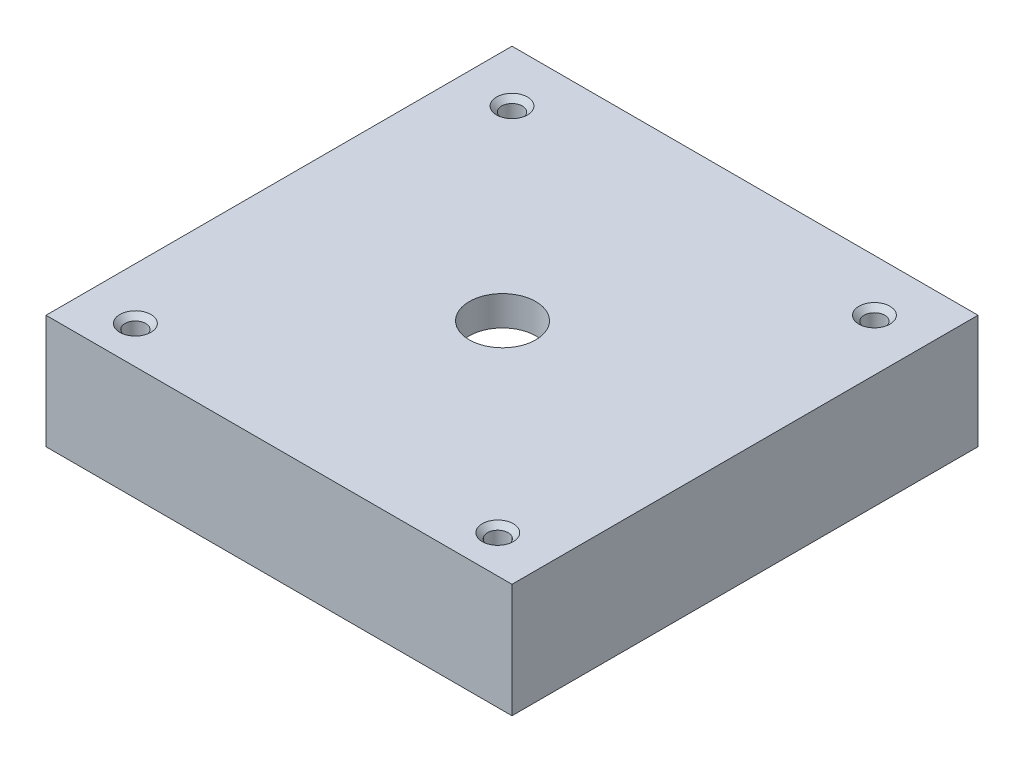
ISO-10303-21;
HEADER;
FILE_DESCRIPTION(('STEP AP214'),'2;1');
FILE_NAME('part.step','',(''),(''),'','','');
FILE_SCHEMA(('AUTOMOTIVE_DESIGN { 1 0 10303 214 1 1 1 1 }'));
ENDSEC;
DATA;
#1=APPLICATION_CONTEXT('core data for automotive mechanical design processes');
#2=APPLICATION_PROTOCOL_DEFINITION('international standard','automotive_design',2000,#1);
#3=PRODUCT_CONTEXT('',#1,'mechanical');
#4=PRODUCT('Part','Part','',(#3));
#5=PRODUCT_RELATED_PRODUCT_CATEGORY('part','',(#4));
#6=PRODUCT_DEFINITION_FORMATION('','',#4);
#7=PRODUCT_DEFINITION_CONTEXT('part definition',#1,'design');
#8=PRODUCT_DEFINITION('design','',#6,#7);
#9=PRODUCT_DEFINITION_SHAPE('','',#8);
#10=(LENGTH_UNIT() NAMED_UNIT(*) SI_UNIT(.MILLI.,.METRE.));
#11=(NAMED_UNIT(*) PLANE_ANGLE_UNIT() SI_UNIT($,.RADIAN.));
#12=(NAMED_UNIT(*) SI_UNIT($,.STERADIAN.) SOLID_ANGLE_UNIT());
#13=UNCERTAINTY_MEASURE_WITH_UNIT(LENGTH_MEASURE(1.E-05),#10,'distance_accuracy_value','');
#14=(GEOMETRIC_REPRESENTATION_CONTEXT(3) GLOBAL_UNCERTAINTY_ASSIGNED_CONTEXT((#13)) GLOBAL_UNIT_ASSIGNED_CONTEXT((#10,
#11,#12)) REPRESENTATION_CONTEXT('',''));
#15=CARTESIAN_POINT('',(0.,0.,0.));
#16=DIRECTION('',(0.,0.,1.));
#17=DIRECTION('',(1.,0.,0.));
#18=AXIS2_PLACEMENT_3D('',#15,#16,#17);
#19=CARTESIAN_POINT('',(0.,22.,0.));
#20=DIRECTION('',(1.,0.,0.));
#21=DIRECTION('',(0.,0.,-1.));
#22=AXIS2_PLACEMENT_3D('',#19,#20,#21);
#23=PLANE('',#22);
#24=DIRECTION('',(0.,0.,1.));
#25=VECTOR('',#24,1.);
#26=CARTESIAN_POINT('',(0.,0.,0.));
#27=LINE('',#26,#25);
#28=CARTESIAN_POINT('',(0.,0.,-90.01));
#29=VERTEX_POINT('',#28);
#30=CARTESIAN_POINT('',(0.,0.,0.));
#31=VERTEX_POINT('',#30);
#32=EDGE_CURVE('E197',#29,#31,#27,.T.);
#33=ORIENTED_EDGE('',*,*,#32,.T.);
#34=DIRECTION('',(0.,-1.,0.));
#35=VECTOR('',#34,1.);
#36=CARTESIAN_POINT('',(0.,22.,0.));
#37=LINE('',#36,#35);
#38=CARTESIAN_POINT('',(0.,22.,0.));
#39=VERTEX_POINT('',#38);
#40=EDGE_CURVE('E212',#39,#31,#37,.T.);
#41=ORIENTED_EDGE('',*,*,#40,.F.);
#42=DIRECTION('',(0.,0.,1.));
#43=VECTOR('',#42,1.);
#44=CARTESIAN_POINT('',(0.,22.,0.));
#45=LINE('',#44,#43);
#46=CARTESIAN_POINT('',(0.,22.,-90.01));
#47=VERTEX_POINT('',#46);
#48=EDGE_CURVE('E190',#47,#39,#45,.T.);
#49=ORIENTED_EDGE('',*,*,#48,.F.);
#50=DIRECTION('',(0.,-1.,0.));
#51=VECTOR('',#50,1.);
#52=CARTESIAN_POINT('',(0.,22.,-90.01));
#53=LINE('',#52,#51);
#54=EDGE_CURVE('E196',#47,#29,#53,.T.);
#55=ORIENTED_EDGE('',*,*,#54,.T.);
#56=EDGE_LOOP('',(#33,#41,#49,#55));
#57=FACE_BOUND('',#56,.T.);
#58=ADVANCED_FACE('F44',(#57),#23,.F.);
#59=CARTESIAN_POINT('',(0.,22.,0.));
#60=DIRECTION('',(0.,0.,-1.));
#61=DIRECTION('',(-1.,0.,0.));
#62=AXIS2_PLACEMENT_3D('',#59,#60,#61);
#63=PLANE('',#62);
#64=DIRECTION('',(1.,0.,0.));
#65=VECTOR('',#64,1.);
#66=CARTESIAN_POINT('',(0.,0.,0.));
#67=LINE('',#66,#65);
#68=CARTESIAN_POINT('',(90.,0.,0.));
#69=VERTEX_POINT('',#68);
#70=EDGE_CURVE('E200',#31,#69,#67,.T.);
#71=ORIENTED_EDGE('',*,*,#70,.T.);
#72=DIRECTION('',(0.,-1.,0.));
#73=VECTOR('',#72,1.);
#74=CARTESIAN_POINT('',(90.,22.,0.));
#75=LINE('',#74,#73);
#76=CARTESIAN_POINT('',(90.,22.,0.));
#77=VERTEX_POINT('',#76);
#78=EDGE_CURVE('E209',#77,#69,#75,.T.);
#79=ORIENTED_EDGE('',*,*,#78,.F.);
#80=DIRECTION('',(1.,0.,0.));
#81=VECTOR('',#80,1.);
#82=CARTESIAN_POINT('',(0.,22.,0.));
#83=LINE('',#82,#81);
#84=EDGE_CURVE('E97',#39,#77,#83,.T.);
#85=ORIENTED_EDGE('',*,*,#84,.F.);
#86=ORIENTED_EDGE('',*,*,#40,.T.);
#87=EDGE_LOOP('',(#71,#79,#85,#86));
#88=FACE_BOUND('',#87,.T.);
#89=ADVANCED_FACE('F268',(#88),#63,.F.);
#90=CARTESIAN_POINT('',(90.,22.,0.));
#91=DIRECTION('',(-1.,0.,0.));
#92=DIRECTION('',(0.,0.,1.));
#93=AXIS2_PLACEMENT_3D('',#90,#91,#92);
#94=PLANE('',#93);
#95=DIRECTION('',(0.,0.,-1.));
#96=VECTOR('',#95,1.);
#97=CARTESIAN_POINT('',(90.,0.,0.));
#98=LINE('',#97,#96);
#99=CARTESIAN_POINT('',(90.,0.,-90.01));
#100=VERTEX_POINT('',#99);
#101=EDGE_CURVE('E203',#69,#100,#98,.T.);
#102=ORIENTED_EDGE('',*,*,#101,.T.);
#103=DIRECTION('',(0.,-1.,0.));
#104=VECTOR('',#103,1.);
#105=CARTESIAN_POINT('',(90.,22.,-90.01));
#106=LINE('',#105,#104);
#107=CARTESIAN_POINT('',(90.,22.,-90.01));
#108=VERTEX_POINT('',#107);
#109=EDGE_CURVE('E207',#108,#100,#106,.T.);
#110=ORIENTED_EDGE('',*,*,#109,.F.);
#111=DIRECTION('',(0.,0.,-1.));
#112=VECTOR('',#111,1.);
#113=CARTESIAN_POINT('',(90.,22.,0.));
#114=LINE('',#113,#112);
#115=EDGE_CURVE('E193',#77,#108,#114,.T.);
#116=ORIENTED_EDGE('',*,*,#115,.F.);
#117=ORIENTED_EDGE('',*,*,#78,.T.);
#118=EDGE_LOOP('',(#102,#110,#116,#117));
#119=FACE_BOUND('',#118,.T.);
#120=ADVANCED_FACE('F273',(#119),#94,.F.);
#121=CARTESIAN_POINT('',(0.,22.,-90.01));
#122=DIRECTION('',(0.,0.,1.));
#123=DIRECTION('',(1.,0.,0.));
#124=AXIS2_PLACEMENT_3D('',#121,#122,#123);
#125=PLANE('',#124);
#126=DIRECTION('',(-1.,0.,0.));
#127=VECTOR('',#126,1.);
#128=CARTESIAN_POINT('',(0.,0.,-90.01));
#129=LINE('',#128,#127);
#130=EDGE_CURVE('E89',#100,#29,#129,.T.);
#131=ORIENTED_EDGE('',*,*,#130,.T.);
#132=ORIENTED_EDGE('',*,*,#54,.F.);
#133=DIRECTION('',(-1.,0.,0.));
#134=VECTOR('',#133,1.);
#135=CARTESIAN_POINT('',(0.,22.,-90.01));
#136=LINE('',#135,#134);
#137=EDGE_CURVE('E68',#108,#47,#136,.T.);
#138=ORIENTED_EDGE('',*,*,#137,.F.);
#139=ORIENTED_EDGE('',*,*,#109,.T.);
#140=EDGE_LOOP('',(#131,#132,#138,#139));
#141=FACE_BOUND('',#140,.T.);
#142=ADVANCED_FACE('F257',(#141),#125,.F.);
#143=CARTESIAN_POINT('',(0.,22.,0.));
#144=DIRECTION('',(0.,-1.,0.));
#145=DIRECTION('',(0.,0.,-1.));
#146=AXIS2_PLACEMENT_3D('',#143,#144,#145);
#147=PLANE('',#146);
#148=CARTESIAN_POINT('',(9.99700000000003,22.,-80.01));
#149=DIRECTION('',(0.,-1.,0.));
#150=DIRECTION('',(0.,0.,-1.));
#151=AXIS2_PLACEMENT_3D('',#148,#149,#150);
#152=CIRCLE('',#151,2.99999999999998);
#153=CARTESIAN_POINT('',(9.99700000000003,22.,-83.01));
#154=VERTEX_POINT('',#153);
#155=EDGE_CURVE('E233',#154,#154,#152,.T.);
#156=ORIENTED_EDGE('',*,*,#155,.T.);
#157=EDGE_LOOP('',(#156));
#158=FACE_BOUND('',#157,.T.);
#159=CARTESIAN_POINT('',(9.99700000000003,22.,-7.26557948291047));
#160=DIRECTION('',(0.,-1.,0.));
#161=DIRECTION('',(0.,0.,-1.));
#162=AXIS2_PLACEMENT_3D('',#159,#160,#161);
#163=CIRCLE('',#162,2.99999999999999);
#164=CARTESIAN_POINT('',(9.99700000000003,22.,-10.2655794829105));
#165=VERTEX_POINT('',#164);
#166=EDGE_CURVE('E230',#165,#165,#163,.T.);
#167=ORIENTED_EDGE('',*,*,#166,.T.);
#168=EDGE_LOOP('',(#167));
#169=FACE_BOUND('',#168,.T.);
#170=CARTESIAN_POINT('',(79.997,22.,-80.01));
#171=DIRECTION('',(0.,-1.,0.));
#172=DIRECTION('',(0.,0.,-1.));
#173=AXIS2_PLACEMENT_3D('',#170,#171,#172);
#174=CIRCLE('',#173,2.99999999999998);
#175=CARTESIAN_POINT('',(79.997,22.,-83.01));
#176=VERTEX_POINT('',#175);
#177=EDGE_CURVE('E227',#176,#176,#174,.T.);
#178=ORIENTED_EDGE('',*,*,#177,.T.);
#179=EDGE_LOOP('',(#178));
#180=FACE_BOUND('',#179,.T.);
#181=CARTESIAN_POINT('',(79.997,22.,-7.26557948291046));
#182=DIRECTION('',(0.,-1.,0.));
#183=DIRECTION('',(0.,0.,-1.));
#184=AXIS2_PLACEMENT_3D('',#181,#182,#183);
#185=CIRCLE('',#184,2.99999999999999);
#186=CARTESIAN_POINT('',(79.997,22.,-10.2655794829105));
#187=VERTEX_POINT('',#186);
#188=EDGE_CURVE('E214',#187,#187,#185,.T.);
#189=ORIENTED_EDGE('',*,*,#188,.T.);
#190=EDGE_LOOP('',(#189));
#191=FACE_BOUND('',#190,.T.);
#192=CARTESIAN_POINT('',(44.9963085252732,22.,-43.1781197698745));
#193=DIRECTION('',(0.,-1.,0.));
#194=DIRECTION('',(0.,0.,-1.));
#195=AXIS2_PLACEMENT_3D('',#192,#193,#194);
#196=CIRCLE('',#195,6.4168545848649);
#197=CARTESIAN_POINT('',(44.9963085252732,22.,-49.5949743547394));
#198=VERTEX_POINT('',#197);
#199=EDGE_CURVE('E170',#198,#198,#196,.T.);
#200=ORIENTED_EDGE('',*,*,#199,.T.);
#201=EDGE_LOOP('',(#200));
#202=FACE_BOUND('',#201,.T.);
#203=ORIENTED_EDGE('',*,*,#48,.T.);
#204=ORIENTED_EDGE('',*,*,#84,.T.);
#205=ORIENTED_EDGE('',*,*,#115,.T.);
#206=ORIENTED_EDGE('',*,*,#137,.T.);
#207=EDGE_LOOP('',(#203,#204,#205,#206));
#208=FACE_BOUND('',#207,.T.);
#209=ADVANCED_FACE('F253',(#158,#169,#180,#191,#202,#208),#147,.F.);
#210=CARTESIAN_POINT('',(0.,0.,0.));
#211=DIRECTION('',(0.,-1.,0.));
#212=DIRECTION('',(0.,0.,-1.));
#213=AXIS2_PLACEMENT_3D('',#210,#211,#212);
#214=PLANE('',#213);
#215=CARTESIAN_POINT('',(63.8998085252733,0.,-32.2641789562485));
#216=DIRECTION('',(0.,-1.,0.));
#217=DIRECTION('',(0.,0.,-1.));
#218=AXIS2_PLACEMENT_3D('',#215,#216,#217);
#219=CIRCLE('',#218,20.5);
#220=CARTESIAN_POINT('',(80.8420507654955,0.,-43.8058611505229));
#221=VERTEX_POINT('',#220);
#222=CARTESIAN_POINT('',(63.8998085252733,0.,-11.7641789562485));
#223=VERTEX_POINT('',#222);
#224=EDGE_CURVE('E59',#221,#223,#219,.T.);
#225=ORIENTED_EDGE('',*,*,#224,.F.);
#226=DIRECTION('',(0.498644314109177,0.,0.866806695870878));
#227=VECTOR('',#226,1.);
#228=CARTESIAN_POINT('',(80.8420507654955,0.,-43.8058611505229));
#229=LINE('',#228,#227);
#230=CARTESIAN_POINT('',(62.7658457906263,0.,-75.2282098363649));
#231=VERTEX_POINT('',#230);
#232=EDGE_CURVE('E152',#231,#221,#229,.T.);
#233=ORIENTED_EDGE('',*,*,#232,.F.);
#234=CARTESIAN_POINT('',(44.9963085252733,0.,-65.0060013971268));
#235=DIRECTION('',(0.,-1.,0.));
#236=DIRECTION('',(0.,0.,-1.));
#237=AXIS2_PLACEMENT_3D('',#234,#235,#236);
#238=CIRCLE('',#237,20.5);
#239=CARTESIAN_POINT('',(27.2427877476923,0.,-75.2560013971268));
#240=VERTEX_POINT('',#239);
#241=EDGE_CURVE('E155',#240,#231,#238,.T.);
#242=ORIENTED_EDGE('',*,*,#241,.F.);
#243=DIRECTION('',(0.5,0.,-0.866025403784438));
#244=VECTOR('',#243,1.);
#245=CARTESIAN_POINT('',(8.33928774769229,0.,-42.5141789562485));
#246=LINE('',#245,#244);
#247=CARTESIAN_POINT('',(8.33928774769229,0.,-42.5141789562485));
#248=VERTEX_POINT('',#247);
#249=EDGE_CURVE('E175',#248,#240,#246,.T.);
#250=ORIENTED_EDGE('',*,*,#249,.F.);
#251=CARTESIAN_POINT('',(26.0928085252733,0.,-32.2641789562485));
#252=DIRECTION('',(0.,-1.,0.));
#253=DIRECTION('',(0.,0.,-1.));
#254=AXIS2_PLACEMENT_3D('',#251,#252,#253);
#255=CIRCLE('',#254,20.5);
#256=CARTESIAN_POINT('',(26.0928085252733,0.,-11.7641789562485));
#257=VERTEX_POINT('',#256);
#258=EDGE_CURVE('E172',#257,#248,#255,.T.);
#259=ORIENTED_EDGE('',*,*,#258,.F.);
#260=DIRECTION('',(-1.,0.,0.));
#261=VECTOR('',#260,1.);
#262=CARTESIAN_POINT('',(26.0928085252733,0.,-11.7641789562485));
#263=LINE('',#262,#261);
#264=EDGE_CURVE('E169',#223,#257,#263,.T.);
#265=ORIENTED_EDGE('',*,*,#264,.F.);
#266=EDGE_LOOP('',(#225,#233,#242,#250,#259,#265));
#267=FACE_BOUND('',#266,.T.);
#268=CARTESIAN_POINT('',(9.99700000000003,0.,-80.01));
#269=DIRECTION('',(0.,-1.,0.));
#270=DIRECTION('',(0.,0.,-1.));
#271=AXIS2_PLACEMENT_3D('',#268,#269,#270);
#272=CIRCLE('',#271,2.);
#273=CARTESIAN_POINT('',(9.99700000000003,0.,-82.01));
#274=VERTEX_POINT('',#273);
#275=EDGE_CURVE('E217',#274,#274,#272,.T.);
#276=ORIENTED_EDGE('',*,*,#275,.F.);
#277=EDGE_LOOP('',(#276));
#278=FACE_BOUND('',#277,.T.);
#279=CARTESIAN_POINT('',(79.997,0.,-7.26557948291046));
#280=DIRECTION('',(0.,-1.,0.));
#281=DIRECTION('',(0.,0.,-1.));
#282=AXIS2_PLACEMENT_3D('',#279,#280,#281);
#283=CIRCLE('',#282,2.);
#284=CARTESIAN_POINT('',(79.997,0.,-9.26557948291046));
#285=VERTEX_POINT('',#284);
#286=EDGE_CURVE('E220',#285,#285,#283,.T.);
#287=ORIENTED_EDGE('',*,*,#286,.F.);
#288=EDGE_LOOP('',(#287));
#289=FACE_BOUND('',#288,.T.);
#290=CARTESIAN_POINT('',(79.997,0.,-80.01));
#291=DIRECTION('',(0.,-1.,0.));
#292=DIRECTION('',(0.,0.,-1.));
#293=AXIS2_PLACEMENT_3D('',#290,#291,#292);
#294=CIRCLE('',#293,2.);
#295=CARTESIAN_POINT('',(79.997,0.,-82.01));
#296=VERTEX_POINT('',#295);
#297=EDGE_CURVE('E182',#296,#296,#294,.T.);
#298=ORIENTED_EDGE('',*,*,#297,.F.);
#299=EDGE_LOOP('',(#298));
#300=FACE_BOUND('',#299,.T.);
#301=CARTESIAN_POINT('',(9.99700000000003,0.,-7.26557948291047));
#302=DIRECTION('',(0.,-1.,0.));
#303=DIRECTION('',(0.,0.,-1.));
#304=AXIS2_PLACEMENT_3D('',#301,#302,#303);
#305=CIRCLE('',#304,2.);
#306=CARTESIAN_POINT('',(9.99700000000003,0.,-9.26557948291047));
#307=VERTEX_POINT('',#306);
#308=EDGE_CURVE('E201',#307,#307,#305,.T.);
#309=ORIENTED_EDGE('',*,*,#308,.F.);
#310=EDGE_LOOP('',(#309));
#311=FACE_BOUND('',#310,.T.);
#312=ORIENTED_EDGE('',*,*,#32,.F.);
#313=ORIENTED_EDGE('',*,*,#130,.F.);
#314=ORIENTED_EDGE('',*,*,#101,.F.);
#315=ORIENTED_EDGE('',*,*,#70,.F.);
#316=EDGE_LOOP('',(#312,#313,#314,#315));
#317=FACE_BOUND('',#316,.T.);
#318=ADVANCED_FACE('F256',(#267,#278,#289,#300,#311,#317),#214,.T.);
#319=CARTESIAN_POINT('',(9.99700000000003,22.,-7.26557948291047));
#320=DIRECTION('',(0.,-1.,0.));
#321=DIRECTION('',(0.,0.,-1.));
#322=AXIS2_PLACEMENT_3D('',#319,#320,#321);
#323=CYLINDRICAL_SURFACE('',#322,2.);
#324=CARTESIAN_POINT('',(9.99700000000003,21.,-7.26557948291047));
#325=DIRECTION('',(0.,-1.,0.));
#326=DIRECTION('',(0.,0.,-1.));
#327=AXIS2_PLACEMENT_3D('',#324,#325,#326);
#328=CIRCLE('',#327,2.);
#329=CARTESIAN_POINT('',(9.99700000000003,21.,-9.26557948291047));
#330=VERTEX_POINT('',#329);
#331=EDGE_CURVE('E239',#330,#330,#328,.F.);
#332=ORIENTED_EDGE('',*,*,#331,.T.);
#333=EDGE_LOOP('',(#332));
#334=FACE_BOUND('',#333,.T.);
#335=ORIENTED_EDGE('',*,*,#308,.T.);
#336=EDGE_LOOP('',(#335));
#337=FACE_BOUND('',#336,.T.);
#338=ADVANCED_FACE('F276',(#334,#337),#323,.F.);
#339=CARTESIAN_POINT('',(79.997,22.,-80.01));
#340=DIRECTION('',(0.,-1.,0.));
#341=DIRECTION('',(0.,0.,-1.));
#342=AXIS2_PLACEMENT_3D('',#339,#340,#341);
#343=CYLINDRICAL_SURFACE('',#342,2.);
#344=CARTESIAN_POINT('',(79.997,21.,-80.01));
#345=DIRECTION('',(0.,-1.,0.));
#346=DIRECTION('',(0.,0.,-1.));
#347=AXIS2_PLACEMENT_3D('',#344,#345,#346);
#348=CIRCLE('',#347,2.);
#349=CARTESIAN_POINT('',(79.997,21.,-82.01));
#350=VERTEX_POINT('',#349);
#351=EDGE_CURVE('E52',#350,#350,#348,.F.);
#352=ORIENTED_EDGE('',*,*,#351,.T.);
#353=EDGE_LOOP('',(#352));
#354=FACE_BOUND('',#353,.T.);
#355=ORIENTED_EDGE('',*,*,#297,.T.);
#356=EDGE_LOOP('',(#355));
#357=FACE_BOUND('',#356,.T.);
#358=ADVANCED_FACE('F244',(#354,#357),#343,.F.);
#359=CARTESIAN_POINT('',(79.997,22.,-7.26557948291046));
#360=DIRECTION('',(0.,-1.,0.));
#361=DIRECTION('',(0.,0.,-1.));
#362=AXIS2_PLACEMENT_3D('',#359,#360,#361);
#363=CYLINDRICAL_SURFACE('',#362,2.);
#364=CARTESIAN_POINT('',(79.997,21.,-7.26557948291046));
#365=DIRECTION('',(0.,-1.,0.));
#366=DIRECTION('',(0.,0.,-1.));
#367=AXIS2_PLACEMENT_3D('',#364,#365,#366);
#368=CIRCLE('',#367,2.);
#369=CARTESIAN_POINT('',(79.997,21.,-9.26557948291046));
#370=VERTEX_POINT('',#369);
#371=EDGE_CURVE('E13',#370,#370,#368,.F.);
#372=ORIENTED_EDGE('',*,*,#371,.T.);
#373=EDGE_LOOP('',(#372));
#374=FACE_BOUND('',#373,.T.);
#375=ORIENTED_EDGE('',*,*,#286,.T.);
#376=EDGE_LOOP('',(#375));
#377=FACE_BOUND('',#376,.T.);
#378=ADVANCED_FACE('F408',(#374,#377),#363,.F.);
#379=CARTESIAN_POINT('',(9.99700000000003,22.,-80.01));
#380=DIRECTION('',(0.,-1.,0.));
#381=DIRECTION('',(0.,0.,-1.));
#382=AXIS2_PLACEMENT_3D('',#379,#380,#381);
#383=CYLINDRICAL_SURFACE('',#382,2.);
#384=CARTESIAN_POINT('',(9.99700000000003,21.,-80.01));
#385=DIRECTION('',(0.,-1.,0.));
#386=DIRECTION('',(0.,0.,-1.));
#387=AXIS2_PLACEMENT_3D('',#384,#385,#386);
#388=CIRCLE('',#387,2.);
#389=CARTESIAN_POINT('',(9.99700000000003,21.,-82.01));
#390=VERTEX_POINT('',#389);
#391=EDGE_CURVE('E236',#390,#390,#388,.F.);
#392=ORIENTED_EDGE('',*,*,#391,.T.);
#393=EDGE_LOOP('',(#392));
#394=FACE_BOUND('',#393,.T.);
#395=ORIENTED_EDGE('',*,*,#275,.T.);
#396=EDGE_LOOP('',(#395));
#397=FACE_BOUND('',#396,.T.);
#398=ADVANCED_FACE('F401',(#394,#397),#383,.F.);
#399=CARTESIAN_POINT('',(63.8998085252733,16.25,-32.2641789562485));
#400=DIRECTION('',(0.,-1.,0.));
#401=DIRECTION('',(0.,0.,-1.));
#402=AXIS2_PLACEMENT_3D('',#399,#400,#401);
#403=CYLINDRICAL_SURFACE('',#402,20.5);
#404=ORIENTED_EDGE('',*,*,#224,.T.);
#405=DIRECTION('',(0.,-1.,0.));
#406=VECTOR('',#405,1.);
#407=CARTESIAN_POINT('',(63.8998085252733,16.25,-11.7641789562485));
#408=LINE('',#407,#406);
#409=CARTESIAN_POINT('',(63.8998085252733,16.25,-11.7641789562485));
#410=VERTEX_POINT('',#409);
#411=EDGE_CURVE('E129',#410,#223,#408,.T.);
#412=ORIENTED_EDGE('',*,*,#411,.F.);
#413=CARTESIAN_POINT('',(63.8998085252733,16.25,-32.2641789562485));
#414=DIRECTION('',(0.,-1.,0.));
#415=DIRECTION('',(0.,0.,-1.));
#416=AXIS2_PLACEMENT_3D('',#413,#414,#415);
#417=CIRCLE('',#416,20.5);
#418=CARTESIAN_POINT('',(80.8420507654955,16.25,-43.8058611505229));
#419=VERTEX_POINT('',#418);
#420=EDGE_CURVE('E133',#419,#410,#417,.T.);
#421=ORIENTED_EDGE('',*,*,#420,.F.);
#422=DIRECTION('',(0.,-1.,0.));
#423=VECTOR('',#422,1.);
#424=CARTESIAN_POINT('',(80.8420507654955,16.25,-43.8058611505229));
#425=LINE('',#424,#423);
#426=EDGE_CURVE('E180',#419,#221,#425,.T.);
#427=ORIENTED_EDGE('',*,*,#426,.T.);
#428=EDGE_LOOP('',(#404,#412,#421,#427));
#429=FACE_BOUND('',#428,.T.);
#430=ADVANCED_FACE('F131',(#429),#403,.F.);
#431=CARTESIAN_POINT('',(80.8420507654955,16.25,-43.8058611505229));
#432=DIRECTION('',(0.866806695870878,0.,-0.498644314109177));
#433=DIRECTION('',(-0.498644314109177,0.,-0.866806695870878));
#434=AXIS2_PLACEMENT_3D('',#431,#432,#433);
#435=PLANE('',#434);
#436=ORIENTED_EDGE('',*,*,#232,.T.);
#437=ORIENTED_EDGE('',*,*,#426,.F.);
#438=DIRECTION('',(0.498644314109177,0.,0.866806695870878));
#439=VECTOR('',#438,1.);
#440=CARTESIAN_POINT('',(80.8420507654955,16.25,-43.8058611505229));
#441=LINE('',#440,#439);
#442=CARTESIAN_POINT('',(62.7658457906263,16.25,-75.2282098363649));
#443=VERTEX_POINT('',#442);
#444=EDGE_CURVE('E139',#443,#419,#441,.T.);
#445=ORIENTED_EDGE('',*,*,#444,.F.);
#446=DIRECTION('',(0.,-1.,0.));
#447=VECTOR('',#446,1.);
#448=CARTESIAN_POINT('',(62.7658457906263,16.25,-75.2282098363649));
#449=LINE('',#448,#447);
#450=EDGE_CURVE('E183',#443,#231,#449,.T.);
#451=ORIENTED_EDGE('',*,*,#450,.T.);
#452=EDGE_LOOP('',(#436,#437,#445,#451));
#453=FACE_BOUND('',#452,.T.);
#454=ADVANCED_FACE('F384',(#453),#435,.F.);
#455=CARTESIAN_POINT('',(44.9963085252733,16.25,-65.0060013971268));
#456=DIRECTION('',(0.,-1.,0.));
#457=DIRECTION('',(0.,0.,-1.));
#458=AXIS2_PLACEMENT_3D('',#455,#456,#457);
#459=CYLINDRICAL_SURFACE('',#458,20.5);
#460=ORIENTED_EDGE('',*,*,#241,.T.);
#461=ORIENTED_EDGE('',*,*,#450,.F.);
#462=CARTESIAN_POINT('',(44.9963085252733,16.25,-65.0060013971268));
#463=DIRECTION('',(0.,-1.,0.));
#464=DIRECTION('',(0.,0.,-1.));
#465=AXIS2_PLACEMENT_3D('',#462,#463,#464);
#466=CIRCLE('',#465,20.5);
#467=CARTESIAN_POINT('',(27.2427877476923,16.25,-75.2560013971268));
#468=VERTEX_POINT('',#467);
#469=EDGE_CURVE('E165',#468,#443,#466,.T.);
#470=ORIENTED_EDGE('',*,*,#469,.F.);
#471=DIRECTION('',(0.,-1.,0.));
#472=VECTOR('',#471,1.);
#473=CARTESIAN_POINT('',(27.2427877476923,16.25,-75.2560013971268));
#474=LINE('',#473,#472);
#475=EDGE_CURVE('E185',#468,#240,#474,.T.);
#476=ORIENTED_EDGE('',*,*,#475,.T.);
#477=EDGE_LOOP('',(#460,#461,#470,#476));
#478=FACE_BOUND('',#477,.T.);
#479=ADVANCED_FACE('F375',(#478),#459,.F.);
#480=CARTESIAN_POINT('',(8.33928774769229,16.25,-42.5141789562485));
#481=DIRECTION('',(-0.866025403784438,0.,-0.5));
#482=DIRECTION('',(-0.5,0.,0.866025403784439));
#483=AXIS2_PLACEMENT_3D('',#480,#481,#482);
#484=PLANE('',#483);
#485=ORIENTED_EDGE('',*,*,#249,.T.);
#486=ORIENTED_EDGE('',*,*,#475,.F.);
#487=DIRECTION('',(0.5,0.,-0.866025403784438));
#488=VECTOR('',#487,1.);
#489=CARTESIAN_POINT('',(8.33928774769229,16.25,-42.5141789562485));
#490=LINE('',#489,#488);
#491=CARTESIAN_POINT('',(8.33928774769229,16.25,-42.5141789562485));
#492=VERTEX_POINT('',#491);
#493=EDGE_CURVE('E162',#492,#468,#490,.T.);
#494=ORIENTED_EDGE('',*,*,#493,.F.);
#495=DIRECTION('',(0.,-1.,0.));
#496=VECTOR('',#495,1.);
#497=CARTESIAN_POINT('',(8.33928774769229,16.25,-42.5141789562485));
#498=LINE('',#497,#496);
#499=EDGE_CURVE('E187',#492,#248,#498,.T.);
#500=ORIENTED_EDGE('',*,*,#499,.T.);
#501=EDGE_LOOP('',(#485,#486,#494,#500));
#502=FACE_BOUND('',#501,.T.);
#503=ADVANCED_FACE('F366',(#502),#484,.F.);
#504=CARTESIAN_POINT('',(26.0928085252733,16.25,-32.2641789562485));
#505=DIRECTION('',(0.,-1.,0.));
#506=DIRECTION('',(0.,0.,-1.));
#507=AXIS2_PLACEMENT_3D('',#504,#505,#506);
#508=CYLINDRICAL_SURFACE('',#507,20.5);
#509=ORIENTED_EDGE('',*,*,#258,.T.);
#510=ORIENTED_EDGE('',*,*,#499,.F.);
#511=CARTESIAN_POINT('',(26.0928085252733,16.25,-32.2641789562485));
#512=DIRECTION('',(0.,-1.,0.));
#513=DIRECTION('',(0.,0.,-1.));
#514=AXIS2_PLACEMENT_3D('',#511,#512,#513);
#515=CIRCLE('',#514,20.5);
#516=CARTESIAN_POINT('',(26.0928085252733,16.25,-11.7641789562485));
#517=VERTEX_POINT('',#516);
#518=EDGE_CURVE('E147',#517,#492,#515,.T.);
#519=ORIENTED_EDGE('',*,*,#518,.F.);
#520=DIRECTION('',(0.,-1.,0.));
#521=VECTOR('',#520,1.);
#522=CARTESIAN_POINT('',(26.0928085252733,16.25,-11.7641789562485));
#523=LINE('',#522,#521);
#524=EDGE_CURVE('E138',#517,#257,#523,.T.);
#525=ORIENTED_EDGE('',*,*,#524,.T.);
#526=EDGE_LOOP('',(#509,#510,#519,#525));
#527=FACE_BOUND('',#526,.T.);
#528=ADVANCED_FACE('F358',(#527),#508,.F.);
#529=CARTESIAN_POINT('',(26.0928085252733,16.25,-11.7641789562485));
#530=DIRECTION('',(0.,0.,1.));
#531=DIRECTION('',(1.,0.,0.));
#532=AXIS2_PLACEMENT_3D('',#529,#530,#531);
#533=PLANE('',#532);
#534=ORIENTED_EDGE('',*,*,#264,.T.);
#535=ORIENTED_EDGE('',*,*,#524,.F.);
#536=DIRECTION('',(-1.,0.,0.));
#537=VECTOR('',#536,1.);
#538=CARTESIAN_POINT('',(26.0928085252733,16.25,-11.7641789562485));
#539=LINE('',#538,#537);
#540=EDGE_CURVE('E142',#410,#517,#539,.T.);
#541=ORIENTED_EDGE('',*,*,#540,.F.);
#542=ORIENTED_EDGE('',*,*,#411,.T.);
#543=EDGE_LOOP('',(#534,#535,#541,#542));
#544=FACE_BOUND('',#543,.T.);
#545=ADVANCED_FACE('F143',(#544),#533,.F.);
#546=CARTESIAN_POINT('',(63.8998085252733,16.25,-32.2641789562485));
#547=DIRECTION('',(0.,-1.,0.));
#548=DIRECTION('',(0.,0.,-1.));
#549=AXIS2_PLACEMENT_3D('',#546,#547,#548);
#550=PLANE('',#549);
#551=CARTESIAN_POINT('',(44.9963085252732,16.25,-43.1781197698745));
#552=DIRECTION('',(0.,-1.,0.));
#553=DIRECTION('',(0.,0.,-1.));
#554=AXIS2_PLACEMENT_3D('',#551,#552,#553);
#555=CIRCLE('',#554,6.4168545848649);
#556=CARTESIAN_POINT('',(44.9963085252732,16.25,-49.5949743547394));
#557=VERTEX_POINT('',#556);
#558=EDGE_CURVE('E158',#557,#557,#555,.T.);
#559=ORIENTED_EDGE('',*,*,#558,.F.);
#560=EDGE_LOOP('',(#559));
#561=FACE_BOUND('',#560,.T.);
#562=ORIENTED_EDGE('',*,*,#420,.T.);
#563=ORIENTED_EDGE('',*,*,#540,.T.);
#564=ORIENTED_EDGE('',*,*,#518,.T.);
#565=ORIENTED_EDGE('',*,*,#493,.T.);
#566=ORIENTED_EDGE('',*,*,#469,.T.);
#567=ORIENTED_EDGE('',*,*,#444,.T.);
#568=EDGE_LOOP('',(#562,#563,#564,#565,#566,#567));
#569=FACE_BOUND('',#568,.T.);
#570=ADVANCED_FACE('F149',(#561,#569),#550,.T.);
#571=CARTESIAN_POINT('',(44.9963085252732,22.,-43.1781197698745));
#572=DIRECTION('',(0.,-1.,0.));
#573=DIRECTION('',(0.,0.,-1.));
#574=AXIS2_PLACEMENT_3D('',#571,#572,#573);
#575=CYLINDRICAL_SURFACE('',#574,6.4168545848649);
#576=ORIENTED_EDGE('',*,*,#199,.F.);
#577=EDGE_LOOP('',(#576));
#578=FACE_BOUND('',#577,.T.);
#579=ORIENTED_EDGE('',*,*,#558,.T.);
#580=EDGE_LOOP('',(#579));
#581=FACE_BOUND('',#580,.T.);
#582=ADVANCED_FACE('F297',(#578,#581),#575,.F.);
#583=CARTESIAN_POINT('',(9.99700000000003,22.,-80.01));
#584=DIRECTION('',(0.,1.,0.));
#585=DIRECTION('',(0.,0.,1.));
#586=AXIS2_PLACEMENT_3D('',#583,#584,#585);
#587=CONICAL_SURFACE('',#586,2.99999999999998,0.785398163397446);
#588=ORIENTED_EDGE('',*,*,#391,.F.);
#589=EDGE_LOOP('',(#588));
#590=FACE_BOUND('',#589,.T.);
#591=ORIENTED_EDGE('',*,*,#155,.F.);
#592=EDGE_LOOP('',(#591));
#593=FACE_BOUND('',#592,.T.);
#594=ADVANCED_FACE('F294',(#590,#593),#587,.F.);
#595=CARTESIAN_POINT('',(9.99700000000003,22.,-7.26557948291047));
#596=DIRECTION('',(0.,1.,0.));
#597=DIRECTION('',(0.,0.,1.));
#598=AXIS2_PLACEMENT_3D('',#595,#596,#597);
#599=CONICAL_SURFACE('',#598,2.99999999999999,0.785398163397451);
#600=ORIENTED_EDGE('',*,*,#331,.F.);
#601=EDGE_LOOP('',(#600));
#602=FACE_BOUND('',#601,.T.);
#603=ORIENTED_EDGE('',*,*,#166,.F.);
#604=EDGE_LOOP('',(#603));
#605=FACE_BOUND('',#604,.T.);
#606=ADVANCED_FACE('F250',(#602,#605),#599,.F.);
#607=CARTESIAN_POINT('',(79.997,22.,-80.01));
#608=DIRECTION('',(0.,1.,0.));
#609=DIRECTION('',(0.,0.,1.));
#610=AXIS2_PLACEMENT_3D('',#607,#608,#609);
#611=CONICAL_SURFACE('',#610,2.99999999999998,0.785398163397444);
#612=ORIENTED_EDGE('',*,*,#351,.F.);
#613=EDGE_LOOP('',(#612));
#614=FACE_BOUND('',#613,.T.);
#615=ORIENTED_EDGE('',*,*,#177,.F.);
#616=EDGE_LOOP('',(#615));
#617=FACE_BOUND('',#616,.T.);
#618=ADVANCED_FACE('F247',(#614,#617),#611,.F.);
#619=CARTESIAN_POINT('',(79.997,22.,-7.26557948291046));
#620=DIRECTION('',(0.,1.,0.));
#621=DIRECTION('',(0.,0.,1.));
#622=AXIS2_PLACEMENT_3D('',#619,#620,#621);
#623=CONICAL_SURFACE('',#622,2.99999999999999,0.785398163397451);
#624=ORIENTED_EDGE('',*,*,#371,.F.);
#625=EDGE_LOOP('',(#624));
#626=FACE_BOUND('',#625,.T.);
#627=ORIENTED_EDGE('',*,*,#188,.F.);
#628=EDGE_LOOP('',(#627));
#629=FACE_BOUND('',#628,.T.);
#630=ADVANCED_FACE('F46',(#626,#629),#623,.F.);
#631=CLOSED_SHELL('',(#58,#89,#120,#142,#209,#318,#338,#358,#378,#398,#430,#454,#479,#503,#528,
#545,#570,#582,#594,#606,#618,#630));
#632=MANIFOLD_SOLID_BREP('B2',#631);
#633=ADVANCED_BREP_SHAPE_REPRESENTATION('',(#18,#632),#14);
#634=SHAPE_DEFINITION_REPRESENTATION(#9,#633);
ENDSEC;
END-ISO-10303-21;
